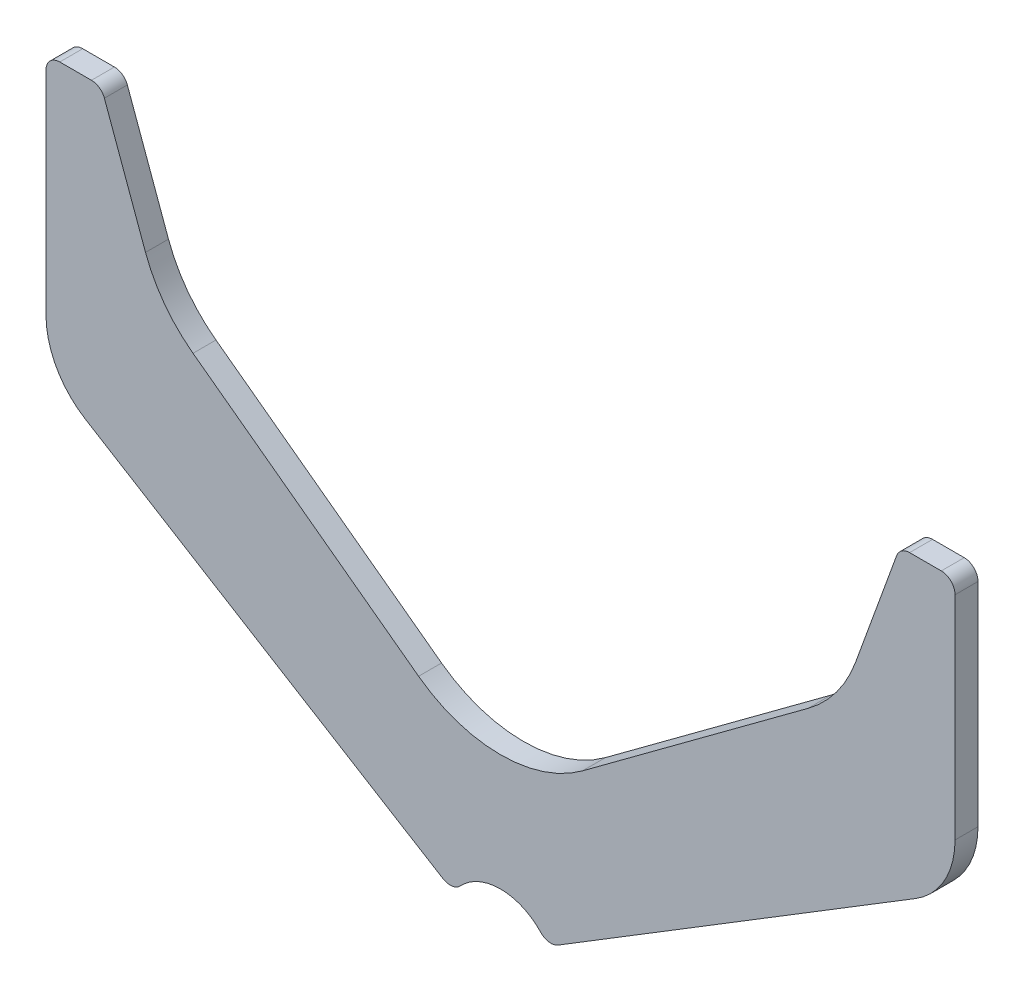
ISO-10303-21;
HEADER;
FILE_DESCRIPTION(('STEP AP214'),'2;1');
FILE_NAME('part.step','',(''),(''),'','','');
FILE_SCHEMA(('AUTOMOTIVE_DESIGN { 1 0 10303 214 1 1 1 1 }'));
ENDSEC;
DATA;
#1=APPLICATION_CONTEXT('core data for automotive mechanical design processes');
#2=APPLICATION_PROTOCOL_DEFINITION('international standard','automotive_design',2000,#1);
#3=PRODUCT_CONTEXT('',#1,'mechanical');
#4=PRODUCT('Part','Part','',(#3));
#5=PRODUCT_RELATED_PRODUCT_CATEGORY('part','',(#4));
#6=PRODUCT_DEFINITION_FORMATION('','',#4);
#7=PRODUCT_DEFINITION_CONTEXT('part definition',#1,'design');
#8=PRODUCT_DEFINITION('design','',#6,#7);
#9=PRODUCT_DEFINITION_SHAPE('','',#8);
#10=(LENGTH_UNIT() NAMED_UNIT(*) SI_UNIT(.MILLI.,.METRE.));
#11=(NAMED_UNIT(*) PLANE_ANGLE_UNIT() SI_UNIT($,.RADIAN.));
#12=(NAMED_UNIT(*) SI_UNIT($,.STERADIAN.) SOLID_ANGLE_UNIT());
#13=UNCERTAINTY_MEASURE_WITH_UNIT(LENGTH_MEASURE(1.E-05),#10,'distance_accuracy_value','');
#14=(GEOMETRIC_REPRESENTATION_CONTEXT(3) GLOBAL_UNCERTAINTY_ASSIGNED_CONTEXT((#13)) GLOBAL_UNIT_ASSIGNED_CONTEXT((#10,
#11,#12)) REPRESENTATION_CONTEXT('',''));
#15=CARTESIAN_POINT('',(0.,0.,0.));
#16=DIRECTION('',(0.,0.,1.));
#17=DIRECTION('',(1.,0.,0.));
#18=AXIS2_PLACEMENT_3D('',#15,#16,#17);
#19=CARTESIAN_POINT('',(-89.1006226146291,117.,5.));
#20=DIRECTION('',(0.,0.,-1.));
#21=DIRECTION('',(-1.,0.,0.));
#22=AXIS2_PLACEMENT_3D('',#19,#20,#21);
#23=CYLINDRICAL_SURFACE('',#22,3.);
#24=CARTESIAN_POINT('',(-89.1006226146291,117.,0.));
#25=DIRECTION('',(0.,0.,1.));
#26=DIRECTION('',(-1.,0.,0.));
#27=AXIS2_PLACEMENT_3D('',#24,#25,#26);
#28=CIRCLE('',#27,3.);
#29=CARTESIAN_POINT('',(-86.2815447522714,118.026060429977,0.));
#30=VERTEX_POINT('',#29);
#31=CARTESIAN_POINT('',(-89.1006226146291,120.,0.));
#32=VERTEX_POINT('',#31);
#33=EDGE_CURVE('E219',#30,#32,#28,.T.);
#34=ORIENTED_EDGE('',*,*,#33,.T.);
#35=DIRECTION('',(0.,0.,-1.));
#36=VECTOR('',#35,1.);
#37=CARTESIAN_POINT('',(-89.1006226146291,120.,5.));
#38=LINE('',#37,#36);
#39=CARTESIAN_POINT('',(-89.1006226146291,120.,5.));
#40=VERTEX_POINT('',#39);
#41=EDGE_CURVE('E11',#40,#32,#38,.T.);
#42=ORIENTED_EDGE('',*,*,#41,.F.);
#43=CARTESIAN_POINT('',(-89.1006226146291,117.,5.));
#44=DIRECTION('',(0.,0.,1.));
#45=DIRECTION('',(-1.,0.,0.));
#46=AXIS2_PLACEMENT_3D('',#43,#44,#45);
#47=CIRCLE('',#46,3.);
#48=CARTESIAN_POINT('',(-86.2815447522714,118.026060429977,5.));
#49=VERTEX_POINT('',#48);
#50=EDGE_CURVE('E261',#49,#40,#47,.T.);
#51=ORIENTED_EDGE('',*,*,#50,.F.);
#52=DIRECTION('',(0.,0.,-1.));
#53=VECTOR('',#52,1.);
#54=CARTESIAN_POINT('',(-86.2815447522714,118.026060429977,5.));
#55=LINE('',#54,#53);
#56=EDGE_CURVE('E215',#49,#30,#55,.T.);
#57=ORIENTED_EDGE('',*,*,#56,.T.);
#58=EDGE_LOOP('',(#34,#42,#51,#57));
#59=FACE_BOUND('',#58,.T.);
#60=ADVANCED_FACE('F39',(#59),#23,.T.);
#61=CARTESIAN_POINT('',(-89.1006226146291,120.,5.));
#62=DIRECTION('',(0.,-1.,0.));
#63=DIRECTION('',(1.,0.,0.));
#64=AXIS2_PLACEMENT_3D('',#61,#62,#63);
#65=PLANE('',#64);
#66=DIRECTION('',(-1.,0.,0.));
#67=VECTOR('',#66,1.);
#68=CARTESIAN_POINT('',(-89.1006226146291,120.,0.));
#69=LINE('',#68,#67);
#70=CARTESIAN_POINT('',(-96.,120.,0.));
#71=VERTEX_POINT('',#70);
#72=EDGE_CURVE('E222',#32,#71,#69,.T.);
#73=ORIENTED_EDGE('',*,*,#72,.T.);
#74=DIRECTION('',(0.,0.,-1.));
#75=VECTOR('',#74,1.);
#76=CARTESIAN_POINT('',(-96.,120.,5.));
#77=LINE('',#76,#75);
#78=CARTESIAN_POINT('',(-96.,120.,5.));
#79=VERTEX_POINT('',#78);
#80=EDGE_CURVE('E47',#79,#71,#77,.T.);
#81=ORIENTED_EDGE('',*,*,#80,.F.);
#82=DIRECTION('',(-1.,0.,0.));
#83=VECTOR('',#82,1.);
#84=CARTESIAN_POINT('',(-89.1006226146291,120.,5.));
#85=LINE('',#84,#83);
#86=EDGE_CURVE('E140',#40,#79,#85,.T.);
#87=ORIENTED_EDGE('',*,*,#86,.F.);
#88=ORIENTED_EDGE('',*,*,#41,.T.);
#89=EDGE_LOOP('',(#73,#81,#87,#88));
#90=FACE_BOUND('',#89,.T.);
#91=ADVANCED_FACE('F389',(#90),#65,.F.);
#92=CARTESIAN_POINT('',(-96.,117.,5.));
#93=DIRECTION('',(0.,0.,-1.));
#94=DIRECTION('',(-1.,0.,0.));
#95=AXIS2_PLACEMENT_3D('',#92,#93,#94);
#96=CYLINDRICAL_SURFACE('',#95,3.);
#97=CARTESIAN_POINT('',(-96.,117.,0.));
#98=DIRECTION('',(0.,0.,1.));
#99=DIRECTION('',(-1.,0.,0.));
#100=AXIS2_PLACEMENT_3D('',#97,#98,#99);
#101=CIRCLE('',#100,3.);
#102=CARTESIAN_POINT('',(-99.,117.,0.));
#103=VERTEX_POINT('',#102);
#104=EDGE_CURVE('E224',#71,#103,#101,.T.);
#105=ORIENTED_EDGE('',*,*,#104,.T.);
#106=DIRECTION('',(0.,0.,-1.));
#107=VECTOR('',#106,1.);
#108=CARTESIAN_POINT('',(-99.,117.,5.));
#109=LINE('',#108,#107);
#110=CARTESIAN_POINT('',(-99.,117.,5.));
#111=VERTEX_POINT('',#110);
#112=EDGE_CURVE('E310',#111,#103,#109,.T.);
#113=ORIENTED_EDGE('',*,*,#112,.F.);
#114=CARTESIAN_POINT('',(-96.,117.,5.));
#115=DIRECTION('',(0.,0.,1.));
#116=DIRECTION('',(-1.,0.,0.));
#117=AXIS2_PLACEMENT_3D('',#114,#115,#116);
#118=CIRCLE('',#117,3.);
#119=EDGE_CURVE('E318',#79,#111,#118,.T.);
#120=ORIENTED_EDGE('',*,*,#119,.F.);
#121=ORIENTED_EDGE('',*,*,#80,.T.);
#122=EDGE_LOOP('',(#105,#113,#120,#121));
#123=FACE_BOUND('',#122,.T.);
#124=ADVANCED_FACE('F316',(#123),#96,.T.);
#125=CARTESIAN_POINT('',(-99.,117.,5.));
#126=DIRECTION('',(1.,0.,0.));
#127=DIRECTION('',(0.,1.,0.));
#128=AXIS2_PLACEMENT_3D('',#125,#126,#127);
#129=PLANE('',#128);
#130=DIRECTION('',(0.,-1.,0.));
#131=VECTOR('',#130,1.);
#132=CARTESIAN_POINT('',(-99.,117.,0.));
#133=LINE('',#132,#131);
#134=CARTESIAN_POINT('',(-99.,70.7477623783863,0.));
#135=VERTEX_POINT('',#134);
#136=EDGE_CURVE('E226',#103,#135,#133,.T.);
#137=ORIENTED_EDGE('',*,*,#136,.T.);
#138=DIRECTION('',(0.,0.,-1.));
#139=VECTOR('',#138,1.);
#140=CARTESIAN_POINT('',(-99.,70.7477623783863,5.));
#141=LINE('',#140,#139);
#142=CARTESIAN_POINT('',(-99.,70.7477623783863,5.));
#143=VERTEX_POINT('',#142);
#144=EDGE_CURVE('E307',#143,#135,#141,.T.);
#145=ORIENTED_EDGE('',*,*,#144,.F.);
#146=DIRECTION('',(0.,-1.,0.));
#147=VECTOR('',#146,1.);
#148=CARTESIAN_POINT('',(-99.,117.,5.));
#149=LINE('',#148,#147);
#150=EDGE_CURVE('E336',#111,#143,#149,.T.);
#151=ORIENTED_EDGE('',*,*,#150,.F.);
#152=ORIENTED_EDGE('',*,*,#112,.T.);
#153=EDGE_LOOP('',(#137,#145,#151,#152));
#154=FACE_BOUND('',#153,.T.);
#155=ADVANCED_FACE('F327',(#154),#129,.F.);
#156=CARTESIAN_POINT('',(-81.,70.7477623783863,5.));
#157=DIRECTION('',(0.,0.,-1.));
#158=DIRECTION('',(-1.,0.,0.));
#159=AXIS2_PLACEMENT_3D('',#156,#157,#158);
#160=CYLINDRICAL_SURFACE('',#159,18.);
#161=CARTESIAN_POINT('',(-81.,70.7477623783863,0.));
#162=DIRECTION('',(0.,0.,1.));
#163=DIRECTION('',(-1.,0.,0.));
#164=AXIS2_PLACEMENT_3D('',#161,#162,#163);
#165=CIRCLE('',#164,18.);
#166=CARTESIAN_POINT('',(-90.404974164887,55.4002394200126,0.));
#167=VERTEX_POINT('',#166);
#168=EDGE_CURVE('E228',#135,#167,#165,.T.);
#169=ORIENTED_EDGE('',*,*,#168,.T.);
#170=DIRECTION('',(0.,0.,-1.));
#171=VECTOR('',#170,1.);
#172=CARTESIAN_POINT('',(-90.404974164887,55.4002394200126,5.));
#173=LINE('',#172,#171);
#174=CARTESIAN_POINT('',(-90.404974164887,55.4002394200126,5.));
#175=VERTEX_POINT('',#174);
#176=EDGE_CURVE('E304',#175,#167,#173,.T.);
#177=ORIENTED_EDGE('',*,*,#176,.F.);
#178=CARTESIAN_POINT('',(-81.,70.7477623783863,5.));
#179=DIRECTION('',(0.,0.,1.));
#180=DIRECTION('',(-1.,0.,0.));
#181=AXIS2_PLACEMENT_3D('',#178,#179,#180);
#182=CIRCLE('',#181,18.);
#183=EDGE_CURVE('E333',#143,#175,#182,.T.);
#184=ORIENTED_EDGE('',*,*,#183,.F.);
#185=ORIENTED_EDGE('',*,*,#144,.T.);
#186=EDGE_LOOP('',(#169,#177,#184,#185));
#187=FACE_BOUND('',#186,.T.);
#188=ADVANCED_FACE('F331',(#187),#160,.T.);
#189=CARTESIAN_POINT('',(-90.404974164887,55.4002394200126,5.));
#190=DIRECTION('',(0.522498564715946,0.852640164354094,0.));
#191=DIRECTION('',(-0.852640164354094,0.522498564715946,0.));
#192=AXIS2_PLACEMENT_3D('',#189,#190,#191);
#193=PLANE('',#192);
#194=DIRECTION('',(0.852640164354094,-0.522498564715946,0.));
#195=VECTOR('',#194,1.);
#196=CARTESIAN_POINT('',(-90.404974164887,55.4002394200126,0.));
#197=LINE('',#196,#195);
#198=CARTESIAN_POINT('',(-12.5312000212219,7.67912924934387,0.));
#199=VERTEX_POINT('',#198);
#200=EDGE_CURVE('E230',#167,#199,#197,.T.);
#201=ORIENTED_EDGE('',*,*,#200,.T.);
#202=DIRECTION('',(0.,0.,-1.));
#203=VECTOR('',#202,1.);
#204=CARTESIAN_POINT('',(-12.5312000212219,7.67912924934387,5.));
#205=LINE('',#204,#203);
#206=CARTESIAN_POINT('',(-12.5312000212219,7.67912924934387,5.));
#207=VERTEX_POINT('',#206);
#208=EDGE_CURVE('E301',#207,#199,#205,.T.);
#209=ORIENTED_EDGE('',*,*,#208,.F.);
#210=DIRECTION('',(0.852640164354094,-0.522498564715946,0.));
#211=VECTOR('',#210,1.);
#212=CARTESIAN_POINT('',(-90.404974164887,55.4002394200126,5.));
#213=LINE('',#212,#211);
#214=EDGE_CURVE('E335',#175,#207,#213,.T.);
#215=ORIENTED_EDGE('',*,*,#214,.F.);
#216=ORIENTED_EDGE('',*,*,#176,.T.);
#217=EDGE_LOOP('',(#201,#209,#215,#216));
#218=FACE_BOUND('',#217,.T.);
#219=ADVANCED_FACE('F402',(#218),#193,.F.);
#220=CARTESIAN_POINT('',(-10.963704327074,10.2370497424062,5.));
#221=DIRECTION('',(0.,0.,-1.));
#222=DIRECTION('',(-1.,0.,0.));
#223=AXIS2_PLACEMENT_3D('',#220,#221,#222);
#224=CYLINDRICAL_SURFACE('',#223,3.);
#225=CARTESIAN_POINT('',(-10.963704327074,10.2370497424062,0.));
#226=DIRECTION('',(0.,0.,1.));
#227=DIRECTION('',(1.,0.,0.));
#228=AXIS2_PLACEMENT_3D('',#225,#226,#227);
#229=CIRCLE('',#228,3.);
#230=CARTESIAN_POINT('',(-8.77096346165923,8.18963979392492,0.));
#231=VERTEX_POINT('',#230);
#232=EDGE_CURVE('E232',#199,#231,#229,.T.);
#233=ORIENTED_EDGE('',*,*,#232,.T.);
#234=DIRECTION('',(0.,0.,-1.));
#235=VECTOR('',#234,1.);
#236=CARTESIAN_POINT('',(-8.77096346165923,8.18963979392492,5.));
#237=LINE('',#236,#235);
#238=CARTESIAN_POINT('',(-8.77096346165923,8.18963979392492,5.));
#239=VERTEX_POINT('',#238);
#240=EDGE_CURVE('E298',#239,#231,#237,.T.);
#241=ORIENTED_EDGE('',*,*,#240,.F.);
#242=CARTESIAN_POINT('',(-10.963704327074,10.2370497424062,5.));
#243=DIRECTION('',(0.,0.,1.));
#244=DIRECTION('',(1.,0.,0.));
#245=AXIS2_PLACEMENT_3D('',#242,#243,#244);
#246=CIRCLE('',#245,3.);
#247=EDGE_CURVE('E338',#207,#239,#246,.T.);
#248=ORIENTED_EDGE('',*,*,#247,.F.);
#249=ORIENTED_EDGE('',*,*,#208,.T.);
#250=EDGE_LOOP('',(#233,#241,#248,#249));
#251=FACE_BOUND('',#250,.T.);
#252=ADVANCED_FACE('F405',(#251),#224,.T.);
#253=CARTESIAN_POINT('',(0.,0.,5.));
#254=DIRECTION('',(0.,0.,-1.));
#255=DIRECTION('',(-1.,0.,0.));
#256=AXIS2_PLACEMENT_3D('',#253,#254,#255);
#257=CYLINDRICAL_SURFACE('',#256,12.);
#258=CARTESIAN_POINT('',(0.,0.,0.));
#259=DIRECTION('',(0.,0.,-1.));
#260=DIRECTION('',(1.,0.,0.));
#261=AXIS2_PLACEMENT_3D('',#258,#259,#260);
#262=CIRCLE('',#261,12.);
#263=CARTESIAN_POINT('',(8.77096346165926,8.18963979392491,0.));
#264=VERTEX_POINT('',#263);
#265=EDGE_CURVE('E234',#231,#264,#262,.T.);
#266=ORIENTED_EDGE('',*,*,#265,.T.);
#267=DIRECTION('',(0.,0.,-1.));
#268=VECTOR('',#267,1.);
#269=CARTESIAN_POINT('',(8.77096346165926,8.18963979392491,5.));
#270=LINE('',#269,#268);
#271=CARTESIAN_POINT('',(8.77096346165926,8.18963979392491,5.));
#272=VERTEX_POINT('',#271);
#273=EDGE_CURVE('E295',#272,#264,#270,.T.);
#274=ORIENTED_EDGE('',*,*,#273,.F.);
#275=CARTESIAN_POINT('',(0.,0.,5.));
#276=DIRECTION('',(0.,0.,-1.));
#277=DIRECTION('',(1.,0.,0.));
#278=AXIS2_PLACEMENT_3D('',#275,#276,#277);
#279=CIRCLE('',#278,12.);
#280=EDGE_CURVE('E344',#239,#272,#279,.T.);
#281=ORIENTED_EDGE('',*,*,#280,.F.);
#282=ORIENTED_EDGE('',*,*,#240,.T.);
#283=EDGE_LOOP('',(#266,#274,#281,#282));
#284=FACE_BOUND('',#283,.T.);
#285=ADVANCED_FACE('F409',(#284),#257,.F.);
#286=CARTESIAN_POINT('',(10.9637043270741,10.2370497424062,5.));
#287=DIRECTION('',(0.,0.,-1.));
#288=DIRECTION('',(-1.,0.,0.));
#289=AXIS2_PLACEMENT_3D('',#286,#287,#288);
#290=CYLINDRICAL_SURFACE('',#289,3.);
#291=CARTESIAN_POINT('',(10.9637043270741,10.2370497424062,0.));
#292=DIRECTION('',(0.,0.,1.));
#293=DIRECTION('',(-1.,0.,0.));
#294=AXIS2_PLACEMENT_3D('',#291,#292,#293);
#295=CIRCLE('',#294,3.);
#296=CARTESIAN_POINT('',(12.5312000212219,7.67912924934388,0.));
#297=VERTEX_POINT('',#296);
#298=EDGE_CURVE('E236',#264,#297,#295,.T.);
#299=ORIENTED_EDGE('',*,*,#298,.T.);
#300=DIRECTION('',(0.,0.,-1.));
#301=VECTOR('',#300,1.);
#302=CARTESIAN_POINT('',(12.5312000212219,7.67912924934388,5.));
#303=LINE('',#302,#301);
#304=CARTESIAN_POINT('',(12.5312000212219,7.67912924934388,5.));
#305=VERTEX_POINT('',#304);
#306=EDGE_CURVE('E292',#305,#297,#303,.T.);
#307=ORIENTED_EDGE('',*,*,#306,.F.);
#308=CARTESIAN_POINT('',(10.9637043270741,10.2370497424062,5.));
#309=DIRECTION('',(0.,0.,1.));
#310=DIRECTION('',(-1.,0.,0.));
#311=AXIS2_PLACEMENT_3D('',#308,#309,#310);
#312=CIRCLE('',#311,3.);
#313=EDGE_CURVE('E346',#272,#305,#312,.T.);
#314=ORIENTED_EDGE('',*,*,#313,.F.);
#315=ORIENTED_EDGE('',*,*,#273,.T.);
#316=EDGE_LOOP('',(#299,#307,#314,#315));
#317=FACE_BOUND('',#316,.T.);
#318=ADVANCED_FACE('F413',(#317),#290,.T.);
#319=CARTESIAN_POINT('',(90.4049741648871,55.4002394200126,5.));
#320=DIRECTION('',(-0.522498564715947,0.852640164354094,0.));
#321=DIRECTION('',(-0.852640164354094,-0.522498564715947,0.));
#322=AXIS2_PLACEMENT_3D('',#319,#320,#321);
#323=PLANE('',#322);
#324=DIRECTION('',(0.852640164354094,0.522498564715947,0.));
#325=VECTOR('',#324,1.);
#326=CARTESIAN_POINT('',(90.4049741648871,55.4002394200126,0.));
#327=LINE('',#326,#325);
#328=CARTESIAN_POINT('',(90.4049741648871,55.4002394200126,0.));
#329=VERTEX_POINT('',#328);
#330=EDGE_CURVE('E238',#297,#329,#327,.T.);
#331=ORIENTED_EDGE('',*,*,#330,.T.);
#332=DIRECTION('',(0.,0.,-1.));
#333=VECTOR('',#332,1.);
#334=CARTESIAN_POINT('',(90.4049741648871,55.4002394200126,5.));
#335=LINE('',#334,#333);
#336=CARTESIAN_POINT('',(90.4049741648871,55.4002394200126,5.));
#337=VERTEX_POINT('',#336);
#338=EDGE_CURVE('E289',#337,#329,#335,.T.);
#339=ORIENTED_EDGE('',*,*,#338,.F.);
#340=DIRECTION('',(0.852640164354094,0.522498564715947,0.));
#341=VECTOR('',#340,1.);
#342=CARTESIAN_POINT('',(90.4049741648871,55.4002394200126,5.));
#343=LINE('',#342,#341);
#344=EDGE_CURVE('E348',#305,#337,#343,.T.);
#345=ORIENTED_EDGE('',*,*,#344,.F.);
#346=ORIENTED_EDGE('',*,*,#306,.T.);
#347=EDGE_LOOP('',(#331,#339,#345,#346));
#348=FACE_BOUND('',#347,.T.);
#349=ADVANCED_FACE('F417',(#348),#323,.F.);
#350=CARTESIAN_POINT('',(81.,70.7477623783863,5.));
#351=DIRECTION('',(0.,0.,-1.));
#352=DIRECTION('',(-1.,0.,0.));
#353=AXIS2_PLACEMENT_3D('',#350,#351,#352);
#354=CYLINDRICAL_SURFACE('',#353,18.);
#355=CARTESIAN_POINT('',(81.,70.7477623783863,0.));
#356=DIRECTION('',(0.,0.,1.));
#357=DIRECTION('',(-1.,0.,0.));
#358=AXIS2_PLACEMENT_3D('',#355,#356,#357);
#359=CIRCLE('',#358,18.);
#360=CARTESIAN_POINT('',(99.,70.7477623783863,0.));
#361=VERTEX_POINT('',#360);
#362=EDGE_CURVE('E240',#329,#361,#359,.T.);
#363=ORIENTED_EDGE('',*,*,#362,.T.);
#364=DIRECTION('',(0.,0.,-1.));
#365=VECTOR('',#364,1.);
#366=CARTESIAN_POINT('',(99.,70.7477623783863,5.));
#367=LINE('',#366,#365);
#368=CARTESIAN_POINT('',(99.,70.7477623783863,5.));
#369=VERTEX_POINT('',#368);
#370=EDGE_CURVE('E286',#369,#361,#367,.T.);
#371=ORIENTED_EDGE('',*,*,#370,.F.);
#372=CARTESIAN_POINT('',(81.,70.7477623783863,5.));
#373=DIRECTION('',(0.,0.,1.));
#374=DIRECTION('',(-1.,0.,0.));
#375=AXIS2_PLACEMENT_3D('',#372,#373,#374);
#376=CIRCLE('',#375,18.);
#377=EDGE_CURVE('E350',#337,#369,#376,.T.);
#378=ORIENTED_EDGE('',*,*,#377,.F.);
#379=ORIENTED_EDGE('',*,*,#338,.T.);
#380=EDGE_LOOP('',(#363,#371,#378,#379));
#381=FACE_BOUND('',#380,.T.);
#382=ADVANCED_FACE('F421',(#381),#354,.T.);
#383=CARTESIAN_POINT('',(99.,117.,5.));
#384=DIRECTION('',(-1.,0.,0.));
#385=DIRECTION('',(0.,-1.,0.));
#386=AXIS2_PLACEMENT_3D('',#383,#384,#385);
#387=PLANE('',#386);
#388=DIRECTION('',(0.,1.,0.));
#389=VECTOR('',#388,1.);
#390=CARTESIAN_POINT('',(99.,117.,0.));
#391=LINE('',#390,#389);
#392=CARTESIAN_POINT('',(99.,117.,0.));
#393=VERTEX_POINT('',#392);
#394=EDGE_CURVE('E242',#361,#393,#391,.T.);
#395=ORIENTED_EDGE('',*,*,#394,.T.);
#396=DIRECTION('',(0.,0.,-1.));
#397=VECTOR('',#396,1.);
#398=CARTESIAN_POINT('',(99.,117.,5.));
#399=LINE('',#398,#397);
#400=CARTESIAN_POINT('',(99.,117.,5.));
#401=VERTEX_POINT('',#400);
#402=EDGE_CURVE('E283',#401,#393,#399,.T.);
#403=ORIENTED_EDGE('',*,*,#402,.F.);
#404=DIRECTION('',(0.,1.,0.));
#405=VECTOR('',#404,1.);
#406=CARTESIAN_POINT('',(99.,117.,5.));
#407=LINE('',#406,#405);
#408=EDGE_CURVE('E352',#369,#401,#407,.T.);
#409=ORIENTED_EDGE('',*,*,#408,.F.);
#410=ORIENTED_EDGE('',*,*,#370,.T.);
#411=EDGE_LOOP('',(#395,#403,#409,#410));
#412=FACE_BOUND('',#411,.T.);
#413=ADVANCED_FACE('F425',(#412),#387,.F.);
#414=CARTESIAN_POINT('',(96.,117.,5.));
#415=DIRECTION('',(0.,0.,-1.));
#416=DIRECTION('',(-1.,0.,0.));
#417=AXIS2_PLACEMENT_3D('',#414,#415,#416);
#418=CYLINDRICAL_SURFACE('',#417,3.);
#419=CARTESIAN_POINT('',(96.,117.,0.));
#420=DIRECTION('',(0.,0.,1.));
#421=DIRECTION('',(1.,0.,0.));
#422=AXIS2_PLACEMENT_3D('',#419,#420,#421);
#423=CIRCLE('',#422,3.);
#424=CARTESIAN_POINT('',(96.,120.,0.));
#425=VERTEX_POINT('',#424);
#426=EDGE_CURVE('E244',#393,#425,#423,.T.);
#427=ORIENTED_EDGE('',*,*,#426,.T.);
#428=DIRECTION('',(0.,0.,-1.));
#429=VECTOR('',#428,1.);
#430=CARTESIAN_POINT('',(96.,120.,5.));
#431=LINE('',#430,#429);
#432=CARTESIAN_POINT('',(96.,120.,5.));
#433=VERTEX_POINT('',#432);
#434=EDGE_CURVE('E280',#433,#425,#431,.T.);
#435=ORIENTED_EDGE('',*,*,#434,.F.);
#436=CARTESIAN_POINT('',(96.,117.,5.));
#437=DIRECTION('',(0.,0.,1.));
#438=DIRECTION('',(1.,0.,0.));
#439=AXIS2_PLACEMENT_3D('',#436,#437,#438);
#440=CIRCLE('',#439,3.);
#441=EDGE_CURVE('E354',#401,#433,#440,.T.);
#442=ORIENTED_EDGE('',*,*,#441,.F.);
#443=ORIENTED_EDGE('',*,*,#402,.T.);
#444=EDGE_LOOP('',(#427,#435,#442,#443));
#445=FACE_BOUND('',#444,.T.);
#446=ADVANCED_FACE('F429',(#445),#418,.T.);
#447=CARTESIAN_POINT('',(89.1006226146292,120.,5.));
#448=DIRECTION('',(0.,-1.,0.));
#449=DIRECTION('',(1.,0.,0.));
#450=AXIS2_PLACEMENT_3D('',#447,#448,#449);
#451=PLANE('',#450);
#452=DIRECTION('',(-1.,0.,0.));
#453=VECTOR('',#452,1.);
#454=CARTESIAN_POINT('',(89.1006226146292,120.,0.));
#455=LINE('',#454,#453);
#456=CARTESIAN_POINT('',(89.1006226146292,120.,0.));
#457=VERTEX_POINT('',#456);
#458=EDGE_CURVE('E246',#425,#457,#455,.T.);
#459=ORIENTED_EDGE('',*,*,#458,.T.);
#460=DIRECTION('',(0.,0.,-1.));
#461=VECTOR('',#460,1.);
#462=CARTESIAN_POINT('',(89.1006226146292,120.,5.));
#463=LINE('',#462,#461);
#464=CARTESIAN_POINT('',(89.1006226146292,120.,5.));
#465=VERTEX_POINT('',#464);
#466=EDGE_CURVE('E277',#465,#457,#463,.T.);
#467=ORIENTED_EDGE('',*,*,#466,.F.);
#468=DIRECTION('',(-1.,0.,0.));
#469=VECTOR('',#468,1.);
#470=CARTESIAN_POINT('',(89.1006226146292,120.,5.));
#471=LINE('',#470,#469);
#472=EDGE_CURVE('E356',#433,#465,#471,.T.);
#473=ORIENTED_EDGE('',*,*,#472,.F.);
#474=ORIENTED_EDGE('',*,*,#434,.T.);
#475=EDGE_LOOP('',(#459,#467,#473,#474));
#476=FACE_BOUND('',#475,.T.);
#477=ADVANCED_FACE('F433',(#476),#451,.F.);
#478=CARTESIAN_POINT('',(89.1006226146292,117.,5.));
#479=DIRECTION('',(0.,0.,-1.));
#480=DIRECTION('',(-1.,0.,0.));
#481=AXIS2_PLACEMENT_3D('',#478,#479,#480);
#482=CYLINDRICAL_SURFACE('',#481,3.);
#483=CARTESIAN_POINT('',(89.1006226146292,117.,0.));
#484=DIRECTION('',(0.,0.,1.));
#485=DIRECTION('',(-1.,0.,0.));
#486=AXIS2_PLACEMENT_3D('',#483,#484,#485);
#487=CIRCLE('',#486,3.);
#488=CARTESIAN_POINT('',(86.2815447522714,118.026060429977,0.));
#489=VERTEX_POINT('',#488);
#490=EDGE_CURVE('E248',#457,#489,#487,.T.);
#491=ORIENTED_EDGE('',*,*,#490,.T.);
#492=DIRECTION('',(0.,0.,-1.));
#493=VECTOR('',#492,1.);
#494=CARTESIAN_POINT('',(86.2815447522714,118.026060429977,5.));
#495=LINE('',#494,#493);
#496=CARTESIAN_POINT('',(86.2815447522714,118.026060429977,5.));
#497=VERTEX_POINT('',#496);
#498=EDGE_CURVE('E274',#497,#489,#495,.T.);
#499=ORIENTED_EDGE('',*,*,#498,.F.);
#500=CARTESIAN_POINT('',(89.1006226146292,117.,5.));
#501=DIRECTION('',(0.,0.,1.));
#502=DIRECTION('',(-1.,0.,0.));
#503=AXIS2_PLACEMENT_3D('',#500,#501,#502);
#504=CIRCLE('',#503,3.);
#505=EDGE_CURVE('E358',#465,#497,#504,.T.);
#506=ORIENTED_EDGE('',*,*,#505,.F.);
#507=ORIENTED_EDGE('',*,*,#466,.T.);
#508=EDGE_LOOP('',(#491,#499,#506,#507));
#509=FACE_BOUND('',#508,.T.);
#510=ADVANCED_FACE('F437',(#509),#482,.T.);
#511=CARTESIAN_POINT('',(77.3243664233073,93.4164152291193,5.));
#512=DIRECTION('',(0.93969262078591,-0.342020143325663,0.));
#513=DIRECTION('',(0.342020143325663,0.93969262078591,0.));
#514=AXIS2_PLACEMENT_3D('',#511,#512,#513);
#515=PLANE('',#514);
#516=DIRECTION('',(-0.342020143325663,-0.93969262078591,0.));
#517=VECTOR('',#516,1.);
#518=CARTESIAN_POINT('',(77.3243664233073,93.4164152291193,0.));
#519=LINE('',#518,#517);
#520=CARTESIAN_POINT('',(77.3243664233073,93.4164152291193,0.));
#521=VERTEX_POINT('',#520);
#522=EDGE_CURVE('E250',#489,#521,#519,.T.);
#523=ORIENTED_EDGE('',*,*,#522,.T.);
#524=DIRECTION('',(0.,0.,-1.));
#525=VECTOR('',#524,1.);
#526=CARTESIAN_POINT('',(77.3243664233073,93.4164152291193,5.));
#527=LINE('',#526,#525);
#528=CARTESIAN_POINT('',(77.3243664233073,93.4164152291193,5.));
#529=VERTEX_POINT('',#528);
#530=EDGE_CURVE('E271',#529,#521,#527,.T.);
#531=ORIENTED_EDGE('',*,*,#530,.F.);
#532=DIRECTION('',(-0.342020143325663,-0.93969262078591,0.));
#533=VECTOR('',#532,1.);
#534=CARTESIAN_POINT('',(77.3243664233073,93.4164152291193,5.));
#535=LINE('',#534,#533);
#536=EDGE_CURVE('E360',#497,#529,#535,.T.);
#537=ORIENTED_EDGE('',*,*,#536,.F.);
#538=ORIENTED_EDGE('',*,*,#498,.T.);
#539=EDGE_LOOP('',(#523,#531,#537,#538));
#540=FACE_BOUND('',#539,.T.);
#541=ADVANCED_FACE('F441',(#540),#515,.F.);
#542=CARTESIAN_POINT('',(49.13358779973,103.677019528889,5.));
#543=DIRECTION('',(0.,0.,-1.));
#544=DIRECTION('',(-1.,0.,0.));
#545=AXIS2_PLACEMENT_3D('',#542,#543,#544);
#546=CYLINDRICAL_SURFACE('',#545,30.);
#547=CARTESIAN_POINT('',(49.13358779973,103.677019528889,0.));
#548=DIRECTION('',(0.,0.,-1.));
#549=DIRECTION('',(1.,0.,0.));
#550=AXIS2_PLACEMENT_3D('',#547,#548,#549);
#551=CIRCLE('',#550,30.);
#552=CARTESIAN_POINT('',(66.97827140227,79.5613137103724,0.));
#553=VERTEX_POINT('',#552);
#554=EDGE_CURVE('E252',#521,#553,#551,.T.);
#555=ORIENTED_EDGE('',*,*,#554,.T.);
#556=DIRECTION('',(0.,0.,-1.));
#557=VECTOR('',#556,1.);
#558=CARTESIAN_POINT('',(66.97827140227,79.5613137103724,5.));
#559=LINE('',#558,#557);
#560=CARTESIAN_POINT('',(66.97827140227,79.5613137103724,5.));
#561=VERTEX_POINT('',#560);
#562=EDGE_CURVE('E268',#561,#553,#559,.T.);
#563=ORIENTED_EDGE('',*,*,#562,.F.);
#564=CARTESIAN_POINT('',(49.13358779973,103.677019528889,5.));
#565=DIRECTION('',(0.,0.,-1.));
#566=DIRECTION('',(1.,0.,0.));
#567=AXIS2_PLACEMENT_3D('',#564,#565,#566);
#568=CIRCLE('',#567,30.);
#569=EDGE_CURVE('E362',#529,#561,#568,.T.);
#570=ORIENTED_EDGE('',*,*,#569,.F.);
#571=ORIENTED_EDGE('',*,*,#530,.T.);
#572=EDGE_LOOP('',(#555,#563,#570,#571));
#573=FACE_BOUND('',#572,.T.);
#574=ADVANCED_FACE('F445',(#573),#546,.F.);
#575=CARTESIAN_POINT('',(17.84468360254,43.2043712620784,5.));
#576=DIRECTION('',(0.594822786751333,-0.803856860617223,0.));
#577=DIRECTION('',(0.803856860617223,0.594822786751333,0.));
#578=AXIS2_PLACEMENT_3D('',#575,#576,#577);
#579=PLANE('',#578);
#580=DIRECTION('',(-0.803856860617223,-0.594822786751333,0.));
#581=VECTOR('',#580,1.);
#582=CARTESIAN_POINT('',(17.84468360254,43.2043712620784,0.));
#583=LINE('',#582,#581);
#584=CARTESIAN_POINT('',(17.84468360254,43.2043712620784,0.));
#585=VERTEX_POINT('',#584);
#586=EDGE_CURVE('E254',#553,#585,#583,.T.);
#587=ORIENTED_EDGE('',*,*,#586,.T.);
#588=DIRECTION('',(0.,0.,-1.));
#589=VECTOR('',#588,1.);
#590=CARTESIAN_POINT('',(17.84468360254,43.2043712620784,5.));
#591=LINE('',#590,#589);
#592=CARTESIAN_POINT('',(17.84468360254,43.2043712620784,5.));
#593=VERTEX_POINT('',#592);
#594=EDGE_CURVE('E265',#593,#585,#591,.T.);
#595=ORIENTED_EDGE('',*,*,#594,.F.);
#596=DIRECTION('',(-0.803856860617223,-0.594822786751333,0.));
#597=VECTOR('',#596,1.);
#598=CARTESIAN_POINT('',(17.84468360254,43.2043712620784,5.));
#599=LINE('',#598,#597);
#600=EDGE_CURVE('E364',#561,#593,#599,.T.);
#601=ORIENTED_EDGE('',*,*,#600,.F.);
#602=ORIENTED_EDGE('',*,*,#562,.T.);
#603=EDGE_LOOP('',(#587,#595,#601,#602));
#604=FACE_BOUND('',#603,.T.);
#605=ADVANCED_FACE('F370',(#604),#579,.F.);
#606=CARTESIAN_POINT('',(0.,67.3200770805951,5.));
#607=DIRECTION('',(0.,0.,-1.));
#608=DIRECTION('',(-1.,0.,0.));
#609=AXIS2_PLACEMENT_3D('',#606,#607,#608);
#610=CYLINDRICAL_SURFACE('',#609,30.);
#611=CARTESIAN_POINT('',(0.,67.3200770805951,0.));
#612=DIRECTION('',(0.,0.,-1.));
#613=DIRECTION('',(-1.,0.,0.));
#614=AXIS2_PLACEMENT_3D('',#611,#612,#613);
#615=CIRCLE('',#614,30.);
#616=CARTESIAN_POINT('',(-17.84468360254,43.2043712620784,0.));
#617=VERTEX_POINT('',#616);
#618=EDGE_CURVE('E256',#585,#617,#615,.T.);
#619=ORIENTED_EDGE('',*,*,#618,.T.);
#620=DIRECTION('',(0.,0.,-1.));
#621=VECTOR('',#620,1.);
#622=CARTESIAN_POINT('',(-17.84468360254,43.2043712620784,5.));
#623=LINE('',#622,#621);
#624=CARTESIAN_POINT('',(-17.84468360254,43.2043712620784,5.));
#625=VERTEX_POINT('',#624);
#626=EDGE_CURVE('E210',#625,#617,#623,.T.);
#627=ORIENTED_EDGE('',*,*,#626,.F.);
#628=CARTESIAN_POINT('',(0.,67.3200770805951,5.));
#629=DIRECTION('',(0.,0.,-1.));
#630=DIRECTION('',(-1.,0.,0.));
#631=AXIS2_PLACEMENT_3D('',#628,#629,#630);
#632=CIRCLE('',#631,30.);
#633=EDGE_CURVE('E201',#593,#625,#632,.T.);
#634=ORIENTED_EDGE('',*,*,#633,.F.);
#635=ORIENTED_EDGE('',*,*,#594,.T.);
#636=EDGE_LOOP('',(#619,#627,#634,#635));
#637=FACE_BOUND('',#636,.T.);
#638=ADVANCED_FACE('F374',(#637),#610,.F.);
#639=CARTESIAN_POINT('',(-17.84468360254,43.2043712620784,5.));
#640=DIRECTION('',(-0.594822786751333,-0.803856860617223,0.));
#641=DIRECTION('',(0.803856860617223,-0.594822786751333,0.));
#642=AXIS2_PLACEMENT_3D('',#639,#640,#641);
#643=PLANE('',#642);
#644=DIRECTION('',(-0.803856860617223,0.594822786751333,0.));
#645=VECTOR('',#644,1.);
#646=CARTESIAN_POINT('',(-17.84468360254,43.2043712620784,0.));
#647=LINE('',#646,#645);
#648=CARTESIAN_POINT('',(-66.97827140227,79.5613137103724,0.));
#649=VERTEX_POINT('',#648);
#650=EDGE_CURVE('E209',#617,#649,#647,.T.);
#651=ORIENTED_EDGE('',*,*,#650,.T.);
#652=DIRECTION('',(0.,0.,-1.));
#653=VECTOR('',#652,1.);
#654=CARTESIAN_POINT('',(-66.97827140227,79.5613137103724,5.));
#655=LINE('',#654,#653);
#656=CARTESIAN_POINT('',(-66.97827140227,79.5613137103724,5.));
#657=VERTEX_POINT('',#656);
#658=EDGE_CURVE('E206',#657,#649,#655,.T.);
#659=ORIENTED_EDGE('',*,*,#658,.F.);
#660=DIRECTION('',(-0.803856860617223,0.594822786751333,0.));
#661=VECTOR('',#660,1.);
#662=CARTESIAN_POINT('',(-17.84468360254,43.2043712620784,5.));
#663=LINE('',#662,#661);
#664=EDGE_CURVE('E195',#625,#657,#663,.T.);
#665=ORIENTED_EDGE('',*,*,#664,.F.);
#666=ORIENTED_EDGE('',*,*,#626,.T.);
#667=EDGE_LOOP('',(#651,#659,#665,#666));
#668=FACE_BOUND('',#667,.T.);
#669=ADVANCED_FACE('F207',(#668),#643,.F.);
#670=CARTESIAN_POINT('',(-49.13358779973,103.677019528889,5.));
#671=DIRECTION('',(0.,0.,-1.));
#672=DIRECTION('',(-1.,0.,0.));
#673=AXIS2_PLACEMENT_3D('',#670,#671,#672);
#674=CYLINDRICAL_SURFACE('',#673,30.);
#675=CARTESIAN_POINT('',(-49.13358779973,103.677019528889,0.));
#676=DIRECTION('',(0.,0.,-1.));
#677=DIRECTION('',(1.,0.,0.));
#678=AXIS2_PLACEMENT_3D('',#675,#676,#677);
#679=CIRCLE('',#678,30.);
#680=CARTESIAN_POINT('',(-77.3243664233073,93.4164152291193,0.));
#681=VERTEX_POINT('',#680);
#682=EDGE_CURVE('E126',#649,#681,#679,.T.);
#683=ORIENTED_EDGE('',*,*,#682,.T.);
#684=DIRECTION('',(0.,0.,-1.));
#685=VECTOR('',#684,1.);
#686=CARTESIAN_POINT('',(-77.3243664233073,93.4164152291193,5.));
#687=LINE('',#686,#685);
#688=CARTESIAN_POINT('',(-77.3243664233073,93.4164152291193,5.));
#689=VERTEX_POINT('',#688);
#690=EDGE_CURVE('E211',#689,#681,#687,.T.);
#691=ORIENTED_EDGE('',*,*,#690,.F.);
#692=CARTESIAN_POINT('',(-49.13358779973,103.677019528889,5.));
#693=DIRECTION('',(0.,0.,-1.));
#694=DIRECTION('',(1.,0.,0.));
#695=AXIS2_PLACEMENT_3D('',#692,#693,#694);
#696=CIRCLE('',#695,30.);
#697=EDGE_CURVE('E199',#657,#689,#696,.T.);
#698=ORIENTED_EDGE('',*,*,#697,.F.);
#699=ORIENTED_EDGE('',*,*,#658,.T.);
#700=EDGE_LOOP('',(#683,#691,#698,#699));
#701=FACE_BOUND('',#700,.T.);
#702=ADVANCED_FACE('F213',(#701),#674,.F.);
#703=CARTESIAN_POINT('',(-77.3243664233073,93.4164152291193,5.));
#704=DIRECTION('',(-0.93969262078591,-0.342020143325663,0.));
#705=DIRECTION('',(0.342020143325663,-0.93969262078591,0.));
#706=AXIS2_PLACEMENT_3D('',#703,#704,#705);
#707=PLANE('',#706);
#708=DIRECTION('',(-0.342020143325663,0.93969262078591,0.));
#709=VECTOR('',#708,1.);
#710=CARTESIAN_POINT('',(-77.3243664233073,93.4164152291193,0.));
#711=LINE('',#710,#709);
#712=EDGE_CURVE('E132',#681,#30,#711,.T.);
#713=ORIENTED_EDGE('',*,*,#712,.T.);
#714=ORIENTED_EDGE('',*,*,#56,.F.);
#715=DIRECTION('',(-0.342020143325663,0.93969262078591,0.));
#716=VECTOR('',#715,1.);
#717=CARTESIAN_POINT('',(-77.3243664233073,93.4164152291193,5.));
#718=LINE('',#717,#716);
#719=EDGE_CURVE('E55',#689,#49,#718,.T.);
#720=ORIENTED_EDGE('',*,*,#719,.F.);
#721=ORIENTED_EDGE('',*,*,#690,.T.);
#722=EDGE_LOOP('',(#713,#714,#720,#721));
#723=FACE_BOUND('',#722,.T.);
#724=ADVANCED_FACE('F378',(#723),#707,.F.);
#725=CARTESIAN_POINT('',(-89.1006226146291,117.,5.));
#726=DIRECTION('',(0.,0.,-1.));
#727=DIRECTION('',(-1.,0.,0.));
#728=AXIS2_PLACEMENT_3D('',#725,#726,#727);
#729=PLANE('',#728);
#730=ORIENTED_EDGE('',*,*,#50,.T.);
#731=ORIENTED_EDGE('',*,*,#86,.T.);
#732=ORIENTED_EDGE('',*,*,#119,.T.);
#733=ORIENTED_EDGE('',*,*,#150,.T.);
#734=ORIENTED_EDGE('',*,*,#183,.T.);
#735=ORIENTED_EDGE('',*,*,#214,.T.);
#736=ORIENTED_EDGE('',*,*,#247,.T.);
#737=ORIENTED_EDGE('',*,*,#280,.T.);
#738=ORIENTED_EDGE('',*,*,#313,.T.);
#739=ORIENTED_EDGE('',*,*,#344,.T.);
#740=ORIENTED_EDGE('',*,*,#377,.T.);
#741=ORIENTED_EDGE('',*,*,#408,.T.);
#742=ORIENTED_EDGE('',*,*,#441,.T.);
#743=ORIENTED_EDGE('',*,*,#472,.T.);
#744=ORIENTED_EDGE('',*,*,#505,.T.);
#745=ORIENTED_EDGE('',*,*,#536,.T.);
#746=ORIENTED_EDGE('',*,*,#569,.T.);
#747=ORIENTED_EDGE('',*,*,#600,.T.);
#748=ORIENTED_EDGE('',*,*,#633,.T.);
#749=ORIENTED_EDGE('',*,*,#664,.T.);
#750=ORIENTED_EDGE('',*,*,#697,.T.);
#751=ORIENTED_EDGE('',*,*,#719,.T.);
#752=EDGE_LOOP('',(#730,#731,#732,#733,#734,#735,#736,#737,#738,#739,#740,#741,#742,#743,#744,
#745,#746,#747,#748,#749,#750,#751));
#753=FACE_BOUND('',#752,.T.);
#754=ADVANCED_FACE('F197',(#753),#729,.F.);
#755=CARTESIAN_POINT('',(-89.1006226146291,117.,0.));
#756=DIRECTION('',(0.,0.,-1.));
#757=DIRECTION('',(-1.,0.,0.));
#758=AXIS2_PLACEMENT_3D('',#755,#756,#757);
#759=PLANE('',#758);
#760=ORIENTED_EDGE('',*,*,#33,.F.);
#761=ORIENTED_EDGE('',*,*,#712,.F.);
#762=ORIENTED_EDGE('',*,*,#682,.F.);
#763=ORIENTED_EDGE('',*,*,#650,.F.);
#764=ORIENTED_EDGE('',*,*,#618,.F.);
#765=ORIENTED_EDGE('',*,*,#586,.F.);
#766=ORIENTED_EDGE('',*,*,#554,.F.);
#767=ORIENTED_EDGE('',*,*,#522,.F.);
#768=ORIENTED_EDGE('',*,*,#490,.F.);
#769=ORIENTED_EDGE('',*,*,#458,.F.);
#770=ORIENTED_EDGE('',*,*,#426,.F.);
#771=ORIENTED_EDGE('',*,*,#394,.F.);
#772=ORIENTED_EDGE('',*,*,#362,.F.);
#773=ORIENTED_EDGE('',*,*,#330,.F.);
#774=ORIENTED_EDGE('',*,*,#298,.F.);
#775=ORIENTED_EDGE('',*,*,#265,.F.);
#776=ORIENTED_EDGE('',*,*,#232,.F.);
#777=ORIENTED_EDGE('',*,*,#200,.F.);
#778=ORIENTED_EDGE('',*,*,#168,.F.);
#779=ORIENTED_EDGE('',*,*,#136,.F.);
#780=ORIENTED_EDGE('',*,*,#104,.F.);
#781=ORIENTED_EDGE('',*,*,#72,.F.);
#782=EDGE_LOOP('',(#760,#761,#762,#763,#764,#765,#766,#767,#768,#769,#770,#771,#772,#773,#774,
#775,#776,#777,#778,#779,#780,#781));
#783=FACE_BOUND('',#782,.T.);
#784=ADVANCED_FACE('F322',(#783),#759,.T.);
#785=CLOSED_SHELL('',(#60,#91,#124,#155,#188,#219,#252,#285,#318,#349,#382,#413,#446,#477,#510,
#541,#574,#605,#638,#669,#702,#724,#754,#784));
#786=MANIFOLD_SOLID_BREP('B2',#785);
#787=ADVANCED_BREP_SHAPE_REPRESENTATION('',(#18,#786),#14);
#788=SHAPE_DEFINITION_REPRESENTATION(#9,#787);
ENDSEC;
END-ISO-10303-21;
